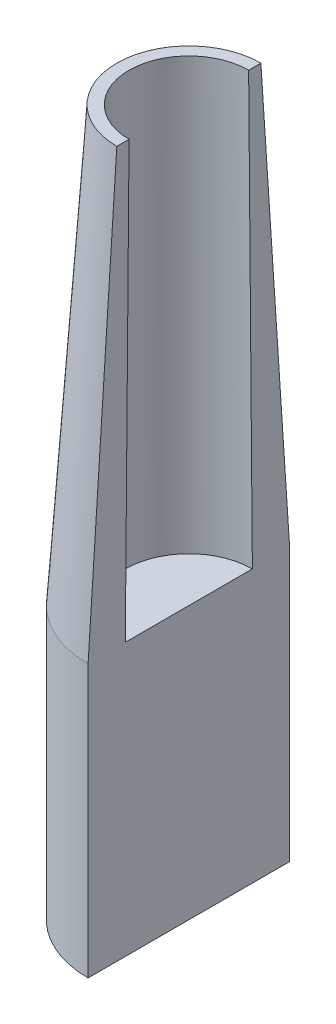
ISO-10303-21;
HEADER;
FILE_DESCRIPTION(('STEP AP214'),'2;1');
FILE_NAME('part.step','',(''),(''),'','','');
FILE_SCHEMA(('AUTOMOTIVE_DESIGN { 1 0 10303 214 1 1 1 1 }'));
ENDSEC;
DATA;
#1=APPLICATION_CONTEXT('core data for automotive mechanical design processes');
#2=APPLICATION_PROTOCOL_DEFINITION('international standard','automotive_design',2000,#1);
#3=PRODUCT_CONTEXT('',#1,'mechanical');
#4=PRODUCT('Part','Part','',(#3));
#5=PRODUCT_RELATED_PRODUCT_CATEGORY('part','',(#4));
#6=PRODUCT_DEFINITION_FORMATION('','',#4);
#7=PRODUCT_DEFINITION_CONTEXT('part definition',#1,'design');
#8=PRODUCT_DEFINITION('design','',#6,#7);
#9=PRODUCT_DEFINITION_SHAPE('','',#8);
#10=(LENGTH_UNIT() NAMED_UNIT(*) SI_UNIT(.MILLI.,.METRE.));
#11=(NAMED_UNIT(*) PLANE_ANGLE_UNIT() SI_UNIT($,.RADIAN.));
#12=(NAMED_UNIT(*) SI_UNIT($,.STERADIAN.) SOLID_ANGLE_UNIT());
#13=UNCERTAINTY_MEASURE_WITH_UNIT(LENGTH_MEASURE(1.E-05),#10,'distance_accuracy_value','');
#14=(GEOMETRIC_REPRESENTATION_CONTEXT(3) GLOBAL_UNCERTAINTY_ASSIGNED_CONTEXT((#13)) GLOBAL_UNIT_ASSIGNED_CONTEXT((#10,
#11,#12)) REPRESENTATION_CONTEXT('',''));
#15=CARTESIAN_POINT('',(0.,0.,0.));
#16=DIRECTION('',(0.,0.,1.));
#17=DIRECTION('',(1.,0.,0.));
#18=AXIS2_PLACEMENT_3D('',#15,#16,#17);
#19=CARTESIAN_POINT('',(0.,-5.09,-25.4));
#20=DIRECTION('',(-1.,0.,0.));
#21=DIRECTION('',(0.,0.,1.));
#22=AXIS2_PLACEMENT_3D('',#19,#20,#21);
#23=PLANE('',#22);
#24=DIRECTION('',(0.,1.,0.));
#25=VECTOR('',#24,1.);
#26=CARTESIAN_POINT('',(0.,-5.08,-25.4));
#27=LINE('',#26,#25);
#28=CARTESIAN_POINT('',(0.,-5.08,-25.4));
#29=VERTEX_POINT('',#28);
#30=CARTESIAN_POINT('',(0.,63.5,-25.4));
#31=VERTEX_POINT('',#30);
#32=EDGE_CURVE('E122',#29,#31,#27,.T.);
#33=ORIENTED_EDGE('',*,*,#32,.T.);
#34=DIRECTION('',(0.,-0.997810065711136,-0.0661443328301023));
#35=VECTOR('',#34,1.);
#36=CARTESIAN_POINT('',(0.,446.66775730677,0.));
#37=LINE('',#36,#35);
#38=CARTESIAN_POINT('',(0.,172.817536,-18.1533949257193));
#39=VERTEX_POINT('',#38);
#40=EDGE_CURVE('E133',#39,#31,#37,.T.);
#41=ORIENTED_EDGE('',*,*,#40,.F.);
#42=DIRECTION('',(0.,0.,1.));
#43=VECTOR('',#42,1.);
#44=CARTESIAN_POINT('',(0.,172.817536,0.));
#45=LINE('',#44,#43);
#46=CARTESIAN_POINT('',(0.,172.817536,-15.06855));
#47=VERTEX_POINT('',#46);
#48=EDGE_CURVE('E98',#39,#47,#45,.T.);
#49=ORIENTED_EDGE('',*,*,#48,.T.);
#50=DIRECTION('',(0.,-0.999963047796073,-0.00859668787320367));
#51=VECTOR('',#50,1.);
#52=CARTESIAN_POINT('',(0.,1925.58481173595,0.));
#53=LINE('',#52,#51);
#54=CARTESIAN_POINT('',(0.,63.5,-16.008353463869));
#55=VERTEX_POINT('',#54);
#56=EDGE_CURVE('E102',#55,#47,#53,.F.);
#57=ORIENTED_EDGE('',*,*,#56,.F.);
#58=DIRECTION('',(0.,0.,1.));
#59=VECTOR('',#58,1.);
#60=CARTESIAN_POINT('',(0.,63.5,0.));
#61=LINE('',#60,#59);
#62=CARTESIAN_POINT('',(0.,63.5,16.008353463869));
#63=VERTEX_POINT('',#62);
#64=EDGE_CURVE('E11',#55,#63,#61,.T.);
#65=ORIENTED_EDGE('',*,*,#64,.T.);
#66=DIRECTION('',(0.,0.999963047796073,-0.00859668787320367));
#67=VECTOR('',#66,1.);
#68=CARTESIAN_POINT('',(0.,1925.58481173595,0.));
#69=LINE('',#68,#67);
#70=CARTESIAN_POINT('',(0.,172.817536,15.06855));
#71=VERTEX_POINT('',#70);
#72=EDGE_CURVE('E58',#71,#63,#69,.F.);
#73=ORIENTED_EDGE('',*,*,#72,.F.);
#74=CARTESIAN_POINT('',(0.,172.817536,18.1533949257193));
#75=VERTEX_POINT('',#74);
#76=EDGE_CURVE('E50',#71,#75,#45,.T.);
#77=ORIENTED_EDGE('',*,*,#76,.T.);
#78=DIRECTION('',(0.,0.997810065711136,-0.0661443328301023));
#79=VECTOR('',#78,1.);
#80=CARTESIAN_POINT('',(0.,446.66775730677,0.));
#81=LINE('',#80,#79);
#82=CARTESIAN_POINT('',(0.,63.5,25.4));
#83=VERTEX_POINT('',#82);
#84=EDGE_CURVE('E131',#83,#75,#81,.T.);
#85=ORIENTED_EDGE('',*,*,#84,.F.);
#86=DIRECTION('',(0.,1.,0.));
#87=VECTOR('',#86,1.);
#88=CARTESIAN_POINT('',(0.,-5.08,25.4));
#89=LINE('',#88,#87);
#90=CARTESIAN_POINT('',(0.,-5.08,25.4));
#91=VERTEX_POINT('',#90);
#92=EDGE_CURVE('E125',#83,#91,#89,.F.);
#93=ORIENTED_EDGE('',*,*,#92,.T.);
#94=DIRECTION('',(0.,0.,1.));
#95=VECTOR('',#94,1.);
#96=CARTESIAN_POINT('',(0.,-5.08,0.));
#97=LINE('',#96,#95);
#98=EDGE_CURVE('E44',#29,#91,#97,.T.);
#99=ORIENTED_EDGE('',*,*,#98,.F.);
#100=EDGE_LOOP('',(#33,#41,#49,#57,#65,#73,#77,#85,#93,#99));
#101=FACE_BOUND('',#100,.T.);
#102=ADVANCED_FACE('F41',(#101),#23,.F.);
#103=CARTESIAN_POINT('',(0.,-5.08,0.));
#104=DIRECTION('',(0.,1.,0.));
#105=DIRECTION('',(0.,0.,1.));
#106=AXIS2_PLACEMENT_3D('',#103,#104,#105);
#107=CYLINDRICAL_SURFACE('',#106,25.4);
#108=ORIENTED_EDGE('',*,*,#92,.F.);
#109=CARTESIAN_POINT('',(0.,63.5,0.));
#110=DIRECTION('',(0.,1.,0.));
#111=DIRECTION('',(0.,0.,1.));
#112=AXIS2_PLACEMENT_3D('',#109,#110,#111);
#113=CIRCLE('',#112,25.4);
#114=EDGE_CURVE('E115',#31,#83,#113,.T.);
#115=ORIENTED_EDGE('',*,*,#114,.F.);
#116=ORIENTED_EDGE('',*,*,#32,.F.);
#117=CARTESIAN_POINT('',(0.,-5.08,0.));
#118=DIRECTION('',(0.,1.,0.));
#119=DIRECTION('',(0.,0.,1.));
#120=AXIS2_PLACEMENT_3D('',#117,#118,#119);
#121=CIRCLE('',#120,25.4);
#122=EDGE_CURVE('E103',#29,#91,#121,.T.);
#123=ORIENTED_EDGE('',*,*,#122,.T.);
#124=EDGE_LOOP('',(#108,#115,#116,#123));
#125=FACE_BOUND('',#124,.T.);
#126=ADVANCED_FACE('F144',(#125),#107,.T.);
#127=CARTESIAN_POINT('',(0.,-5.08,0.));
#128=DIRECTION('',(0.,1.,0.));
#129=DIRECTION('',(0.,0.,1.));
#130=AXIS2_PLACEMENT_3D('',#127,#128,#129);
#131=PLANE('',#130);
#132=ORIENTED_EDGE('',*,*,#122,.F.);
#133=ORIENTED_EDGE('',*,*,#98,.T.);
#134=EDGE_LOOP('',(#132,#133));
#135=FACE_BOUND('',#134,.T.);
#136=ADVANCED_FACE('F140',(#135),#131,.F.);
#137=CARTESIAN_POINT('',(0.,63.5,0.));
#138=DIRECTION('',(0.,-1.,0.));
#139=DIRECTION('',(0.,0.,1.));
#140=AXIS2_PLACEMENT_3D('',#137,#138,#139);
#141=CONICAL_SURFACE('',#140,25.4,0.0661926590794363);
#142=CARTESIAN_POINT('',(0.,172.817536,0.));
#143=DIRECTION('',(0.,1.,0.));
#144=DIRECTION('',(0.,0.,1.));
#145=AXIS2_PLACEMENT_3D('',#142,#143,#144);
#146=CIRCLE('',#145,18.1533949257193);
#147=EDGE_CURVE('E94',#39,#75,#146,.T.);
#148=ORIENTED_EDGE('',*,*,#147,.F.);
#149=ORIENTED_EDGE('',*,*,#40,.T.);
#150=ORIENTED_EDGE('',*,*,#114,.T.);
#151=ORIENTED_EDGE('',*,*,#84,.T.);
#152=EDGE_LOOP('',(#148,#149,#150,#151));
#153=FACE_BOUND('',#152,.T.);
#154=ADVANCED_FACE('F145',(#153),#141,.T.);
#155=CARTESIAN_POINT('',(0.,172.817536,0.));
#156=DIRECTION('',(0.,1.,0.));
#157=DIRECTION('',(0.,0.,1.));
#158=AXIS2_PLACEMENT_3D('',#155,#156,#157);
#159=PLANE('',#158);
#160=ORIENTED_EDGE('',*,*,#48,.F.);
#161=ORIENTED_EDGE('',*,*,#147,.T.);
#162=ORIENTED_EDGE('',*,*,#76,.F.);
#163=CARTESIAN_POINT('',(0.,172.817536,0.));
#164=DIRECTION('',(0.,1.,0.));
#165=DIRECTION('',(0.,0.,1.));
#166=AXIS2_PLACEMENT_3D('',#163,#164,#165);
#167=CIRCLE('',#166,15.06855);
#168=EDGE_CURVE('E92',#47,#71,#167,.T.);
#169=ORIENTED_EDGE('',*,*,#168,.F.);
#170=EDGE_LOOP('',(#160,#161,#162,#169));
#171=FACE_BOUND('',#170,.T.);
#172=ADVANCED_FACE('F91',(#171),#159,.T.);
#173=CARTESIAN_POINT('',(0.,172.817536,0.));
#174=DIRECTION('',(0.,-1.,0.));
#175=DIRECTION('',(0.,0.,1.));
#176=AXIS2_PLACEMENT_3D('',#173,#174,#175);
#177=CONICAL_SURFACE('',#176,15.06855,0.00859679376362329);
#178=CARTESIAN_POINT('',(0.,63.5,0.));
#179=DIRECTION('',(0.,1.,0.));
#180=DIRECTION('',(0.,0.,1.));
#181=AXIS2_PLACEMENT_3D('',#178,#179,#180);
#182=CIRCLE('',#181,16.008353463869);
#183=EDGE_CURVE('E108',#55,#63,#182,.T.);
#184=ORIENTED_EDGE('',*,*,#183,.F.);
#185=ORIENTED_EDGE('',*,*,#56,.T.);
#186=ORIENTED_EDGE('',*,*,#168,.T.);
#187=ORIENTED_EDGE('',*,*,#72,.T.);
#188=EDGE_LOOP('',(#184,#185,#186,#187));
#189=FACE_BOUND('',#188,.T.);
#190=ADVANCED_FACE('F105',(#189),#177,.F.);
#191=CARTESIAN_POINT('',(0.,63.5,0.));
#192=DIRECTION('',(0.,1.,0.));
#193=DIRECTION('',(0.,0.,1.));
#194=AXIS2_PLACEMENT_3D('',#191,#192,#193);
#195=PLANE('',#194);
#196=ORIENTED_EDGE('',*,*,#64,.F.);
#197=ORIENTED_EDGE('',*,*,#183,.T.);
#198=EDGE_LOOP('',(#196,#197));
#199=FACE_BOUND('',#198,.T.);
#200=ADVANCED_FACE('F155',(#199),#195,.T.);
#201=CLOSED_SHELL('',(#102,#126,#136,#154,#172,#190,#200));
#202=MANIFOLD_SOLID_BREP('B2',#201);
#203=ADVANCED_BREP_SHAPE_REPRESENTATION('',(#18,#202),#14);
#204=SHAPE_DEFINITION_REPRESENTATION(#9,#203);
ENDSEC;
END-ISO-10303-21;
